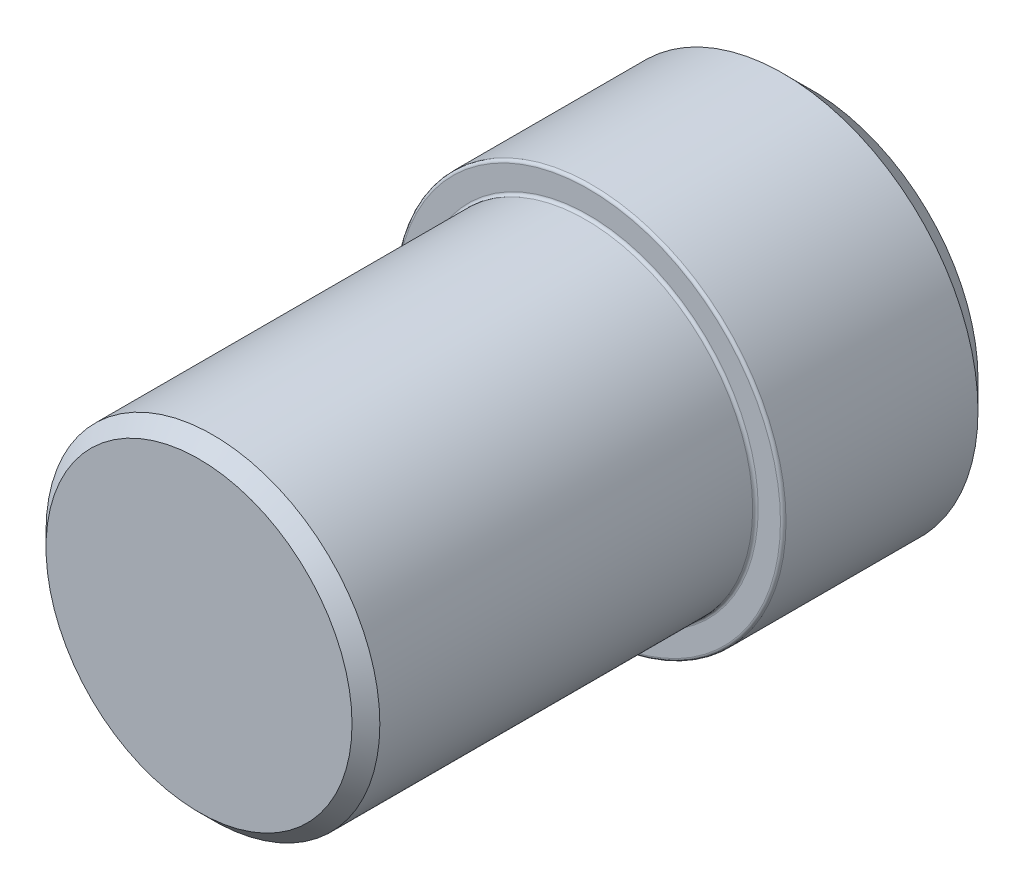
ISO-10303-21;
HEADER;
FILE_DESCRIPTION(('STEP AP214'),'2;1');
FILE_NAME('part.step','',(''),(''),'','','');
FILE_SCHEMA(('AUTOMOTIVE_DESIGN { 1 0 10303 214 1 1 1 1 }'));
ENDSEC;
DATA;
#1=APPLICATION_CONTEXT('core data for automotive mechanical design processes');
#2=APPLICATION_PROTOCOL_DEFINITION('international standard','automotive_design',2000,#1);
#3=PRODUCT_CONTEXT('',#1,'mechanical');
#4=PRODUCT('Part','Part','',(#3));
#5=PRODUCT_RELATED_PRODUCT_CATEGORY('part','',(#4));
#6=PRODUCT_DEFINITION_FORMATION('','',#4);
#7=PRODUCT_DEFINITION_CONTEXT('part definition',#1,'design');
#8=PRODUCT_DEFINITION('design','',#6,#7);
#9=PRODUCT_DEFINITION_SHAPE('','',#8);
#10=(LENGTH_UNIT() NAMED_UNIT(*) SI_UNIT(.MILLI.,.METRE.));
#11=(NAMED_UNIT(*) PLANE_ANGLE_UNIT() SI_UNIT($,.RADIAN.));
#12=(NAMED_UNIT(*) SI_UNIT($,.STERADIAN.) SOLID_ANGLE_UNIT());
#13=UNCERTAINTY_MEASURE_WITH_UNIT(LENGTH_MEASURE(1.E-05),#10,'distance_accuracy_value','');
#14=(GEOMETRIC_REPRESENTATION_CONTEXT(3) GLOBAL_UNCERTAINTY_ASSIGNED_CONTEXT((#13)) GLOBAL_UNIT_ASSIGNED_CONTEXT((#10,
#11,#12)) REPRESENTATION_CONTEXT('',''));
#15=CARTESIAN_POINT('',(0.,0.,0.));
#16=DIRECTION('',(0.,0.,1.));
#17=DIRECTION('',(1.,0.,0.));
#18=AXIS2_PLACEMENT_3D('',#15,#16,#17);
#19=CARTESIAN_POINT('',(0.,0.,4.));
#20=DIRECTION('',(0.,0.,-1.));
#21=DIRECTION('',(-1.,0.,0.));
#22=AXIS2_PLACEMENT_3D('',#19,#20,#21);
#23=CYLINDRICAL_SURFACE('',#22,3.5);
#24=CARTESIAN_POINT('',(0.,0.,3.95));
#25=DIRECTION('',(0.,0.,1.));
#26=DIRECTION('',(1.,0.,0.));
#27=AXIS2_PLACEMENT_3D('',#24,#25,#26);
#28=CIRCLE('',#27,3.5);
#29=CARTESIAN_POINT('',(3.5,0.,3.95));
#30=VERTEX_POINT('',#29);
#31=EDGE_CURVE('E42',#30,#30,#28,.F.);
#32=ORIENTED_EDGE('',*,*,#31,.T.);
#33=EDGE_LOOP('',(#32));
#34=FACE_BOUND('',#33,.T.);
#35=CARTESIAN_POINT('',(0.,0.,0.5));
#36=DIRECTION('',(0.,0.,1.));
#37=DIRECTION('',(1.,0.,0.));
#38=AXIS2_PLACEMENT_3D('',#35,#36,#37);
#39=CIRCLE('',#38,3.5);
#40=CARTESIAN_POINT('',(3.5,0.,0.5));
#41=VERTEX_POINT('',#40);
#42=EDGE_CURVE('E58',#41,#41,#39,.T.);
#43=ORIENTED_EDGE('',*,*,#42,.T.);
#44=EDGE_LOOP('',(#43));
#45=FACE_BOUND('',#44,.T.);
#46=ADVANCED_FACE('F35',(#34,#45),#23,.T.);
#47=CARTESIAN_POINT('',(0.,0.,4.));
#48=DIRECTION('',(0.,0.,1.));
#49=DIRECTION('',(1.,0.,0.));
#50=AXIS2_PLACEMENT_3D('',#47,#48,#49);
#51=PLANE('',#50);
#52=CARTESIAN_POINT('',(0.,0.,4.));
#53=DIRECTION('',(0.,0.,1.));
#54=DIRECTION('',(1.,0.,0.));
#55=AXIS2_PLACEMENT_3D('',#52,#53,#54);
#56=CIRCLE('',#55,3.45);
#57=CARTESIAN_POINT('',(3.45,0.,4.));
#58=VERTEX_POINT('',#57);
#59=EDGE_CURVE('E46',#58,#58,#56,.T.);
#60=ORIENTED_EDGE('',*,*,#59,.T.);
#61=EDGE_LOOP('',(#60));
#62=FACE_BOUND('',#61,.T.);
#63=CARTESIAN_POINT('',(0.,0.,4.));
#64=DIRECTION('',(0.,0.,1.));
#65=DIRECTION('',(1.,0.,0.));
#66=AXIS2_PLACEMENT_3D('',#63,#64,#65);
#67=CIRCLE('',#66,3.05);
#68=CARTESIAN_POINT('',(3.05,0.,4.));
#69=VERTEX_POINT('',#68);
#70=EDGE_CURVE('E50',#69,#69,#67,.F.);
#71=ORIENTED_EDGE('',*,*,#70,.T.);
#72=EDGE_LOOP('',(#71));
#73=FACE_BOUND('',#72,.T.);
#74=ADVANCED_FACE('F87',(#62,#73),#51,.T.);
#75=CARTESIAN_POINT('',(0.,0.,0.));
#76=DIRECTION('',(0.,0.,1.));
#77=DIRECTION('',(1.,0.,0.));
#78=AXIS2_PLACEMENT_3D('',#75,#76,#77);
#79=PLANE('',#78);
#80=CARTESIAN_POINT('',(0.,0.,0.));
#81=DIRECTION('',(0.,0.,1.));
#82=DIRECTION('',(1.,0.,0.));
#83=AXIS2_PLACEMENT_3D('',#80,#81,#82);
#84=CIRCLE('',#83,3.);
#85=CARTESIAN_POINT('',(3.,0.,0.));
#86=VERTEX_POINT('',#85);
#87=EDGE_CURVE('E55',#86,#86,#84,.F.);
#88=ORIENTED_EDGE('',*,*,#87,.T.);
#89=EDGE_LOOP('',(#88));
#90=FACE_BOUND('',#89,.T.);
#91=ADVANCED_FACE('F91',(#90),#79,.F.);
#92=CARTESIAN_POINT('',(0.,0.,11.));
#93=DIRECTION('',(0.,0.,-1.));
#94=DIRECTION('',(-1.,0.,0.));
#95=AXIS2_PLACEMENT_3D('',#92,#93,#94);
#96=CYLINDRICAL_SURFACE('',#95,3.);
#97=CARTESIAN_POINT('',(0.,0.,4.05));
#98=DIRECTION('',(0.,0.,1.));
#99=DIRECTION('',(1.,0.,0.));
#100=AXIS2_PLACEMENT_3D('',#97,#98,#99);
#101=CIRCLE('',#100,3.);
#102=CARTESIAN_POINT('',(3.,0.,4.05));
#103=VERTEX_POINT('',#102);
#104=EDGE_CURVE('E10',#103,#103,#101,.T.);
#105=ORIENTED_EDGE('',*,*,#104,.T.);
#106=EDGE_LOOP('',(#105));
#107=FACE_BOUND('',#106,.T.);
#108=CARTESIAN_POINT('',(0.,0.,10.75));
#109=DIRECTION('',(0.,0.,1.));
#110=DIRECTION('',(1.,0.,0.));
#111=AXIS2_PLACEMENT_3D('',#108,#109,#110);
#112=CIRCLE('',#111,3.);
#113=CARTESIAN_POINT('',(3.,0.,10.75));
#114=VERTEX_POINT('',#113);
#115=EDGE_CURVE('E61',#114,#114,#112,.F.);
#116=ORIENTED_EDGE('',*,*,#115,.T.);
#117=EDGE_LOOP('',(#116));
#118=FACE_BOUND('',#117,.T.);
#119=ADVANCED_FACE('F82',(#107,#118),#96,.T.);
#120=CARTESIAN_POINT('',(0.,0.,11.));
#121=DIRECTION('',(0.,0.,1.));
#122=DIRECTION('',(1.,0.,0.));
#123=AXIS2_PLACEMENT_3D('',#120,#121,#122);
#124=PLANE('',#123);
#125=CARTESIAN_POINT('',(0.,0.,11.));
#126=DIRECTION('',(0.,0.,1.));
#127=DIRECTION('',(1.,0.,0.));
#128=AXIS2_PLACEMENT_3D('',#125,#126,#127);
#129=CIRCLE('',#128,2.75);
#130=CARTESIAN_POINT('',(2.75,0.,11.));
#131=VERTEX_POINT('',#130);
#132=EDGE_CURVE('E64',#131,#131,#129,.T.);
#133=ORIENTED_EDGE('',*,*,#132,.T.);
#134=EDGE_LOOP('',(#133));
#135=FACE_BOUND('',#134,.T.);
#136=ADVANCED_FACE('F68',(#135),#124,.T.);
#137=CARTESIAN_POINT('',(0.,0.,11.));
#138=DIRECTION('',(0.,0.,-1.));
#139=DIRECTION('',(-1.,0.,0.));
#140=AXIS2_PLACEMENT_3D('',#137,#138,#139);
#141=CONICAL_SURFACE('',#140,2.75,0.785398163397447);
#142=ORIENTED_EDGE('',*,*,#115,.F.);
#143=EDGE_LOOP('',(#142));
#144=FACE_BOUND('',#143,.T.);
#145=ORIENTED_EDGE('',*,*,#132,.F.);
#146=EDGE_LOOP('',(#145));
#147=FACE_BOUND('',#146,.T.);
#148=ADVANCED_FACE('F70',(#144,#147),#141,.T.);
#149=CARTESIAN_POINT('',(0.,0.,0.5));
#150=DIRECTION('',(0.,0.,1.));
#151=DIRECTION('',(1.,0.,0.));
#152=AXIS2_PLACEMENT_3D('',#149,#150,#151);
#153=CONICAL_SURFACE('',#152,3.5,0.78539816339745);
#154=ORIENTED_EDGE('',*,*,#87,.F.);
#155=EDGE_LOOP('',(#154));
#156=FACE_BOUND('',#155,.T.);
#157=ORIENTED_EDGE('',*,*,#42,.F.);
#158=EDGE_LOOP('',(#157));
#159=FACE_BOUND('',#158,.T.);
#160=ADVANCED_FACE('F72',(#156,#159),#153,.T.);
#161=CARTESIAN_POINT('',(0.,0.,3.95));
#162=DIRECTION('',(0.,0.,1.));
#163=DIRECTION('',(1.,0.,0.));
#164=AXIS2_PLACEMENT_3D('',#161,#162,#163);
#165=TOROIDAL_SURFACE('',#164,3.45,0.05);
#166=ORIENTED_EDGE('',*,*,#31,.F.);
#167=EDGE_LOOP('',(#166));
#168=FACE_BOUND('',#167,.T.);
#169=ORIENTED_EDGE('',*,*,#59,.F.);
#170=EDGE_LOOP('',(#169));
#171=FACE_BOUND('',#170,.T.);
#172=ADVANCED_FACE('F79',(#168,#171),#165,.T.);
#173=CARTESIAN_POINT('',(0.,0.,4.05));
#174=DIRECTION('',(0.,0.,1.));
#175=DIRECTION('',(1.,0.,0.));
#176=AXIS2_PLACEMENT_3D('',#173,#174,#175);
#177=TOROIDAL_SURFACE('',#176,3.05,0.05);
#178=ORIENTED_EDGE('',*,*,#70,.F.);
#179=EDGE_LOOP('',(#178));
#180=FACE_BOUND('',#179,.T.);
#181=ORIENTED_EDGE('',*,*,#104,.F.);
#182=EDGE_LOOP('',(#181));
#183=FACE_BOUND('',#182,.T.);
#184=ADVANCED_FACE('F37',(#180,#183),#177,.F.);
#185=CLOSED_SHELL('',(#46,#74,#91,#119,#136,#148,#160,#172,#184));
#186=MANIFOLD_SOLID_BREP('B2',#185);
#187=ADVANCED_BREP_SHAPE_REPRESENTATION('',(#18,#186),#14);
#188=SHAPE_DEFINITION_REPRESENTATION(#9,#187);
ENDSEC;
END-ISO-10303-21;
